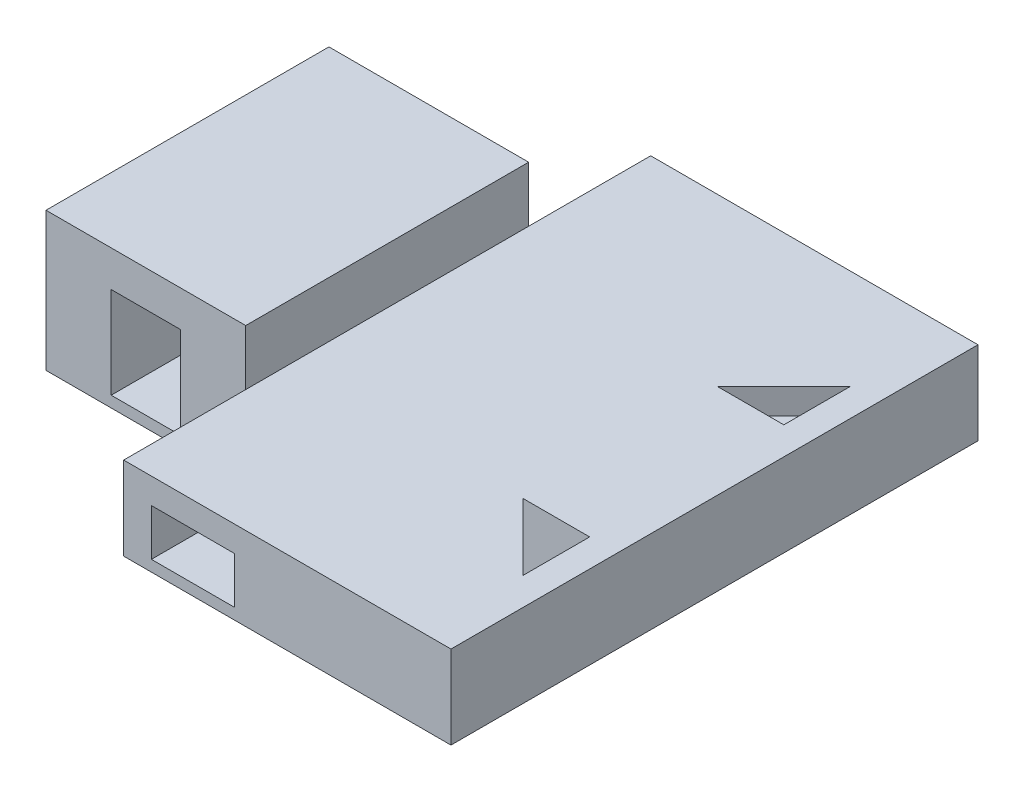
ISO-10303-21;
HEADER;
FILE_DESCRIPTION(('STEP AP214'),'2;1');
FILE_NAME('part.step','',(''),(''),'','','');
FILE_SCHEMA(('AUTOMOTIVE_DESIGN { 1 0 10303 214 1 1 1 1 }'));
ENDSEC;
DATA;
#1=APPLICATION_CONTEXT('core data for automotive mechanical design processes');
#2=APPLICATION_PROTOCOL_DEFINITION('international standard','automotive_design',2000,#1);
#3=PRODUCT_CONTEXT('',#1,'mechanical');
#4=PRODUCT('Part','Part','',(#3));
#5=PRODUCT_RELATED_PRODUCT_CATEGORY('part','',(#4));
#6=PRODUCT_DEFINITION_FORMATION('','',#4);
#7=PRODUCT_DEFINITION_CONTEXT('part definition',#1,'design');
#8=PRODUCT_DEFINITION('design','',#6,#7);
#9=PRODUCT_DEFINITION_SHAPE('','',#8);
#10=(LENGTH_UNIT() NAMED_UNIT(*) SI_UNIT(.MILLI.,.METRE.));
#11=(NAMED_UNIT(*) PLANE_ANGLE_UNIT() SI_UNIT($,.RADIAN.));
#12=(NAMED_UNIT(*) SI_UNIT($,.STERADIAN.) SOLID_ANGLE_UNIT());
#13=UNCERTAINTY_MEASURE_WITH_UNIT(LENGTH_MEASURE(1.E-05),#10,'distance_accuracy_value','');
#14=(GEOMETRIC_REPRESENTATION_CONTEXT(3) GLOBAL_UNCERTAINTY_ASSIGNED_CONTEXT((#13)) GLOBAL_UNIT_ASSIGNED_CONTEXT((#10,
#11,#12)) REPRESENTATION_CONTEXT('',''));
#15=CARTESIAN_POINT('',(0.,0.,0.));
#16=DIRECTION('',(0.,0.,1.));
#17=DIRECTION('',(1.,0.,0.));
#18=AXIS2_PLACEMENT_3D('',#15,#16,#17);
#19=CARTESIAN_POINT('',(0.,15.,0.));
#20=DIRECTION('',(0.,-1.,0.));
#21=DIRECTION('',(0.,0.,-1.));
#22=AXIS2_PLACEMENT_3D('',#19,#20,#21);
#23=PLANE('',#22);
#24=DIRECTION('',(-1.,0.,0.));
#25=VECTOR('',#24,1.);
#26=CARTESIAN_POINT('',(33.,15.,17.5));
#27=LINE('',#26,#25);
#28=CARTESIAN_POINT('',(45.,15.,17.5));
#29=VERTEX_POINT('',#28);
#30=CARTESIAN_POINT('',(33.,15.,17.5));
#31=VERTEX_POINT('',#30);
#32=EDGE_CURVE('E475',#29,#31,#27,.T.);
#33=ORIENTED_EDGE('',*,*,#32,.F.);
#34=DIRECTION('',(0.,0.,-1.));
#35=VECTOR('',#34,1.);
#36=CARTESIAN_POINT('',(45.,15.,29.5));
#37=LINE('',#36,#35);
#38=CARTESIAN_POINT('',(45.,15.,29.5));
#39=VERTEX_POINT('',#38);
#40=EDGE_CURVE('E455',#39,#29,#37,.T.);
#41=ORIENTED_EDGE('',*,*,#40,.F.);
#42=DIRECTION('',(0.707106781186547,0.,0.707106781186548));
#43=VECTOR('',#42,1.);
#44=CARTESIAN_POINT('',(45.,15.,29.5));
#45=LINE('',#44,#43);
#46=EDGE_CURVE('E466',#31,#39,#45,.T.);
#47=ORIENTED_EDGE('',*,*,#46,.F.);
#48=EDGE_LOOP('',(#33,#41,#47));
#49=FACE_BOUND('',#48,.T.);
#50=DIRECTION('',(1.,0.,0.));
#51=VECTOR('',#50,1.);
#52=CARTESIAN_POINT('',(33.,15.,-17.5));
#53=LINE('',#52,#51);
#54=CARTESIAN_POINT('',(33.,15.,-17.5));
#55=VERTEX_POINT('',#54);
#56=CARTESIAN_POINT('',(45.,15.,-17.5));
#57=VERTEX_POINT('',#56);
#58=EDGE_CURVE('E420',#55,#57,#53,.T.);
#59=ORIENTED_EDGE('',*,*,#58,.F.);
#60=DIRECTION('',(-0.707106781186547,0.,0.707106781186548));
#61=VECTOR('',#60,1.);
#62=CARTESIAN_POINT('',(33.,15.,-17.5));
#63=LINE('',#62,#61);
#64=CARTESIAN_POINT('',(45.,15.,-29.5));
#65=VERTEX_POINT('',#64);
#66=EDGE_CURVE('E401',#65,#55,#63,.T.);
#67=ORIENTED_EDGE('',*,*,#66,.F.);
#68=DIRECTION('',(0.,0.,-1.));
#69=VECTOR('',#68,1.);
#70=CARTESIAN_POINT('',(45.,15.,-17.5));
#71=LINE('',#70,#69);
#72=EDGE_CURVE('E423',#57,#65,#71,.T.);
#73=ORIENTED_EDGE('',*,*,#72,.F.);
#74=EDGE_LOOP('',(#59,#67,#73));
#75=FACE_BOUND('',#74,.T.);
#76=DIRECTION('',(0.,0.,-1.));
#77=VECTOR('',#76,1.);
#78=CARTESIAN_POINT('',(-9.,15.,25.5));
#79=LINE('',#78,#77);
#80=CARTESIAN_POINT('',(-9.,15.,25.5));
#81=VERTEX_POINT('',#80);
#82=CARTESIAN_POINT('',(-9.,15.,-25.5));
#83=VERTEX_POINT('',#82);
#84=EDGE_CURVE('E330',#81,#83,#79,.T.);
#85=ORIENTED_EDGE('',*,*,#84,.F.);
#86=DIRECTION('',(0.,0.,1.));
#87=VECTOR('',#86,1.);
#88=CARTESIAN_POINT('',(-9.,15.,25.5));
#89=LINE('',#88,#87);
#90=CARTESIAN_POINT('',(-9.,15.,47.5));
#91=VERTEX_POINT('',#90);
#92=EDGE_CURVE('E374',#81,#91,#89,.T.);
#93=ORIENTED_EDGE('',*,*,#92,.T.);
#94=DIRECTION('',(1.,0.,0.));
#95=VECTOR('',#94,1.);
#96=CARTESIAN_POINT('',(-45.,15.,47.5));
#97=LINE('',#96,#95);
#98=CARTESIAN_POINT('',(50.,15.,47.5));
#99=VERTEX_POINT('',#98);
#100=EDGE_CURVE('E522',#91,#99,#97,.T.);
#101=ORIENTED_EDGE('',*,*,#100,.T.);
#102=DIRECTION('',(0.,0.,1.));
#103=VECTOR('',#102,1.);
#104=CARTESIAN_POINT('',(50.,15.,47.5));
#105=LINE('',#104,#103);
#106=CARTESIAN_POINT('',(50.,15.,-47.5));
#107=VERTEX_POINT('',#106);
#108=EDGE_CURVE('E495',#107,#99,#105,.T.);
#109=ORIENTED_EDGE('',*,*,#108,.F.);
#110=DIRECTION('',(-1.,0.,0.));
#111=VECTOR('',#110,1.);
#112=CARTESIAN_POINT('',(-45.,15.,-47.5));
#113=LINE('',#112,#111);
#114=CARTESIAN_POINT('',(-9.,15.,-47.5));
#115=VERTEX_POINT('',#114);
#116=EDGE_CURVE('E519',#107,#115,#113,.T.);
#117=ORIENTED_EDGE('',*,*,#116,.T.);
#118=DIRECTION('',(0.,0.,-1.));
#119=VECTOR('',#118,1.);
#120=CARTESIAN_POINT('',(-9.,15.,-25.5));
#121=LINE('',#120,#119);
#122=EDGE_CURVE('E356',#83,#115,#121,.T.);
#123=ORIENTED_EDGE('',*,*,#122,.F.);
#124=EDGE_LOOP('',(#85,#93,#101,#109,#117,#123));
#125=FACE_BOUND('',#124,.T.);
#126=ADVANCED_FACE('F33',(#49,#75,#125),#23,.F.);
#127=CARTESIAN_POINT('',(-45.,15.,-47.5));
#128=DIRECTION('',(0.,0.,1.));
#129=DIRECTION('',(1.,0.,0.));
#130=AXIS2_PLACEMENT_3D('',#127,#128,#129);
#131=PLANE('',#130);
#132=DIRECTION('',(-1.,0.,0.));
#133=VECTOR('',#132,1.);
#134=CARTESIAN_POINT('',(11.,2.,-47.5));
#135=LINE('',#134,#133);
#136=CARTESIAN_POINT('',(11.,2.,-47.5));
#137=VERTEX_POINT('',#136);
#138=CARTESIAN_POINT('',(-4.,2.,-47.5));
#139=VERTEX_POINT('',#138);
#140=EDGE_CURVE('E269',#137,#139,#135,.T.);
#141=ORIENTED_EDGE('',*,*,#140,.F.);
#142=DIRECTION('',(0.,-1.,0.));
#143=VECTOR('',#142,1.);
#144=CARTESIAN_POINT('',(11.,2.,-47.5));
#145=LINE('',#144,#143);
#146=CARTESIAN_POINT('',(11.,10.4,-47.5));
#147=VERTEX_POINT('',#146);
#148=EDGE_CURVE('E48',#147,#137,#145,.T.);
#149=ORIENTED_EDGE('',*,*,#148,.F.);
#150=DIRECTION('',(1.,0.,0.));
#151=VECTOR('',#150,1.);
#152=CARTESIAN_POINT('',(11.,10.4,-47.5));
#153=LINE('',#152,#151);
#154=CARTESIAN_POINT('',(-4.,10.4,-47.5));
#155=VERTEX_POINT('',#154);
#156=EDGE_CURVE('E277',#155,#147,#153,.T.);
#157=ORIENTED_EDGE('',*,*,#156,.F.);
#158=DIRECTION('',(0.,1.,0.));
#159=VECTOR('',#158,1.);
#160=CARTESIAN_POINT('',(-4.,2.,-47.5));
#161=LINE('',#160,#159);
#162=EDGE_CURVE('E262',#139,#155,#161,.T.);
#163=ORIENTED_EDGE('',*,*,#162,.F.);
#164=EDGE_LOOP('',(#141,#149,#157,#163));
#165=FACE_BOUND('',#164,.T.);
#166=DIRECTION('',(-1.,0.,0.));
#167=VECTOR('',#166,1.);
#168=CARTESIAN_POINT('',(-45.,0.,-47.5));
#169=LINE('',#168,#167);
#170=CARTESIAN_POINT('',(50.,0.,-47.5));
#171=VERTEX_POINT('',#170);
#172=CARTESIAN_POINT('',(-9.,0.,-47.5));
#173=VERTEX_POINT('',#172);
#174=EDGE_CURVE('E513',#171,#173,#169,.T.);
#175=ORIENTED_EDGE('',*,*,#174,.T.);
#176=DIRECTION('',(0.,-1.,0.));
#177=VECTOR('',#176,1.);
#178=CARTESIAN_POINT('',(-9.,15.,-47.5));
#179=LINE('',#178,#177);
#180=EDGE_CURVE('E349',#115,#173,#179,.T.);
#181=ORIENTED_EDGE('',*,*,#180,.F.);
#182=ORIENTED_EDGE('',*,*,#116,.F.);
#183=DIRECTION('',(0.,1.,0.));
#184=VECTOR('',#183,1.);
#185=CARTESIAN_POINT('',(50.,0.,-47.5));
#186=LINE('',#185,#184);
#187=EDGE_CURVE('E492',#171,#107,#186,.T.);
#188=ORIENTED_EDGE('',*,*,#187,.F.);
#189=EDGE_LOOP('',(#175,#181,#182,#188));
#190=FACE_BOUND('',#189,.T.);
#191=ADVANCED_FACE('F35',(#165,#190),#131,.F.);
#192=CARTESIAN_POINT('',(-45.,15.,47.5));
#193=DIRECTION('',(1.,0.,0.));
#194=DIRECTION('',(0.,0.,-1.));
#195=AXIS2_PLACEMENT_3D('',#192,#193,#194);
#196=PLANE('',#195);
#197=DIRECTION('',(0.,-1.,0.));
#198=VECTOR('',#197,1.);
#199=CARTESIAN_POINT('',(-45.,0.,25.5));
#200=LINE('',#199,#198);
#201=CARTESIAN_POINT('',(-45.,25.,25.5));
#202=VERTEX_POINT('',#201);
#203=CARTESIAN_POINT('',(-45.,0.,25.5));
#204=VERTEX_POINT('',#203);
#205=EDGE_CURVE('E363',#202,#204,#200,.T.);
#206=ORIENTED_EDGE('',*,*,#205,.F.);
#207=DIRECTION('',(0.,0.,1.));
#208=VECTOR('',#207,1.);
#209=CARTESIAN_POINT('',(-45.,25.,25.5));
#210=LINE('',#209,#208);
#211=CARTESIAN_POINT('',(-45.,25.,-25.5));
#212=VERTEX_POINT('',#211);
#213=EDGE_CURVE('E331',#212,#202,#210,.T.);
#214=ORIENTED_EDGE('',*,*,#213,.F.);
#215=DIRECTION('',(0.,1.,0.));
#216=VECTOR('',#215,1.);
#217=CARTESIAN_POINT('',(-45.,15.,-25.5));
#218=LINE('',#217,#216);
#219=CARTESIAN_POINT('',(-45.,0.,-25.5));
#220=VERTEX_POINT('',#219);
#221=EDGE_CURVE('E350',#220,#212,#218,.T.);
#222=ORIENTED_EDGE('',*,*,#221,.F.);
#223=DIRECTION('',(0.,0.,1.));
#224=VECTOR('',#223,1.);
#225=CARTESIAN_POINT('',(-45.,0.,47.5));
#226=LINE('',#225,#224);
#227=EDGE_CURVE('E527',#220,#204,#226,.T.);
#228=ORIENTED_EDGE('',*,*,#227,.T.);
#229=EDGE_LOOP('',(#206,#214,#222,#228));
#230=FACE_BOUND('',#229,.T.);
#231=ADVANCED_FACE('F572',(#230),#196,.F.);
#232=CARTESIAN_POINT('',(-45.,15.,47.5));
#233=DIRECTION('',(0.,0.,-1.));
#234=DIRECTION('',(-1.,0.,0.));
#235=AXIS2_PLACEMENT_3D('',#232,#233,#234);
#236=PLANE('',#235);
#237=DIRECTION('',(1.,0.,0.));
#238=VECTOR('',#237,1.);
#239=CARTESIAN_POINT('',(-45.,10.4,47.5));
#240=LINE('',#239,#238);
#241=CARTESIAN_POINT('',(-4.,10.4,47.5));
#242=VERTEX_POINT('',#241);
#243=CARTESIAN_POINT('',(11.,10.4,47.5));
#244=VERTEX_POINT('',#243);
#245=EDGE_CURVE('E289',#242,#244,#240,.T.);
#246=ORIENTED_EDGE('',*,*,#245,.T.);
#247=DIRECTION('',(0.,-1.,0.));
#248=VECTOR('',#247,1.);
#249=CARTESIAN_POINT('',(11.,15.,47.5));
#250=LINE('',#249,#248);
#251=CARTESIAN_POINT('',(11.,2.,47.5));
#252=VERTEX_POINT('',#251);
#253=EDGE_CURVE('E295',#244,#252,#250,.T.);
#254=ORIENTED_EDGE('',*,*,#253,.T.);
#255=DIRECTION('',(-1.,0.,0.));
#256=VECTOR('',#255,1.);
#257=CARTESIAN_POINT('',(-45.,2.,47.5));
#258=LINE('',#257,#256);
#259=CARTESIAN_POINT('',(-4.,2.,47.5));
#260=VERTEX_POINT('',#259);
#261=EDGE_CURVE('E287',#252,#260,#258,.T.);
#262=ORIENTED_EDGE('',*,*,#261,.T.);
#263=DIRECTION('',(0.,1.,0.));
#264=VECTOR('',#263,1.);
#265=CARTESIAN_POINT('',(-4.,15.,47.5));
#266=LINE('',#265,#264);
#267=EDGE_CURVE('E11',#260,#242,#266,.T.);
#268=ORIENTED_EDGE('',*,*,#267,.T.);
#269=EDGE_LOOP('',(#246,#254,#262,#268));
#270=FACE_BOUND('',#269,.T.);
#271=ORIENTED_EDGE('',*,*,#100,.F.);
#272=DIRECTION('',(0.,1.,0.));
#273=VECTOR('',#272,1.);
#274=CARTESIAN_POINT('',(-9.,0.,47.5));
#275=LINE('',#274,#273);
#276=CARTESIAN_POINT('',(-9.,0.,47.5));
#277=VERTEX_POINT('',#276);
#278=EDGE_CURVE('E361',#277,#91,#275,.T.);
#279=ORIENTED_EDGE('',*,*,#278,.F.);
#280=DIRECTION('',(1.,0.,0.));
#281=VECTOR('',#280,1.);
#282=CARTESIAN_POINT('',(-45.,0.,47.5));
#283=LINE('',#282,#281);
#284=CARTESIAN_POINT('',(50.,0.,47.5));
#285=VERTEX_POINT('',#284);
#286=EDGE_CURVE('E523',#277,#285,#283,.T.);
#287=ORIENTED_EDGE('',*,*,#286,.T.);
#288=DIRECTION('',(0.,-1.,0.));
#289=VECTOR('',#288,1.);
#290=CARTESIAN_POINT('',(50.,0.,47.5));
#291=LINE('',#290,#289);
#292=EDGE_CURVE('E482',#99,#285,#291,.T.);
#293=ORIENTED_EDGE('',*,*,#292,.F.);
#294=EDGE_LOOP('',(#271,#279,#287,#293));
#295=FACE_BOUND('',#294,.T.);
#296=ADVANCED_FACE('F552',(#270,#295),#236,.F.);
#297=CARTESIAN_POINT('',(0.,0.,0.));
#298=DIRECTION('',(0.,-1.,0.));
#299=DIRECTION('',(0.,0.,-1.));
#300=AXIS2_PLACEMENT_3D('',#297,#298,#299);
#301=PLANE('',#300);
#302=DIRECTION('',(0.,0.,-1.));
#303=VECTOR('',#302,1.);
#304=CARTESIAN_POINT('',(-9.,0.,-25.5));
#305=LINE('',#304,#303);
#306=CARTESIAN_POINT('',(-9.,0.,-25.5));
#307=VERTEX_POINT('',#306);
#308=EDGE_CURVE('E358',#307,#173,#305,.T.);
#309=ORIENTED_EDGE('',*,*,#308,.T.);
#310=ORIENTED_EDGE('',*,*,#174,.F.);
#311=DIRECTION('',(0.,0.,-1.));
#312=VECTOR('',#311,1.);
#313=CARTESIAN_POINT('',(50.,0.,47.5));
#314=LINE('',#313,#312);
#315=EDGE_CURVE('E489',#285,#171,#314,.T.);
#316=ORIENTED_EDGE('',*,*,#315,.F.);
#317=ORIENTED_EDGE('',*,*,#286,.F.);
#318=DIRECTION('',(0.,0.,1.));
#319=VECTOR('',#318,1.);
#320=CARTESIAN_POINT('',(-9.,0.,25.5));
#321=LINE('',#320,#319);
#322=CARTESIAN_POINT('',(-9.,0.,25.5));
#323=VERTEX_POINT('',#322);
#324=EDGE_CURVE('E372',#323,#277,#321,.T.);
#325=ORIENTED_EDGE('',*,*,#324,.F.);
#326=DIRECTION('',(1.,0.,0.));
#327=VECTOR('',#326,1.);
#328=CARTESIAN_POINT('',(-45.,0.,25.5));
#329=LINE('',#328,#327);
#330=EDGE_CURVE('E366',#204,#323,#329,.T.);
#331=ORIENTED_EDGE('',*,*,#330,.F.);
#332=ORIENTED_EDGE('',*,*,#227,.F.);
#333=DIRECTION('',(-1.,0.,0.));
#334=VECTOR('',#333,1.);
#335=CARTESIAN_POINT('',(-45.,0.,-25.5));
#336=LINE('',#335,#334);
#337=EDGE_CURVE('E354',#307,#220,#336,.T.);
#338=ORIENTED_EDGE('',*,*,#337,.F.);
#339=EDGE_LOOP('',(#309,#310,#316,#317,#325,#331,#332,#338));
#340=FACE_BOUND('',#339,.T.);
#341=ADVANCED_FACE('F577',(#340),#301,.T.);
#342=CARTESIAN_POINT('',(50.,0.,0.));
#343=DIRECTION('',(-1.,0.,0.));
#344=DIRECTION('',(0.,0.,1.));
#345=AXIS2_PLACEMENT_3D('',#342,#343,#344);
#346=PLANE('',#345);
#347=ORIENTED_EDGE('',*,*,#292,.T.);
#348=ORIENTED_EDGE('',*,*,#315,.T.);
#349=ORIENTED_EDGE('',*,*,#187,.T.);
#350=ORIENTED_EDGE('',*,*,#108,.T.);
#351=EDGE_LOOP('',(#347,#348,#349,#350));
#352=FACE_BOUND('',#351,.T.);
#353=ADVANCED_FACE('F580',(#352),#346,.F.);
#354=CARTESIAN_POINT('',(45.,2.,29.5));
#355=DIRECTION('',(1.,0.,0.));
#356=DIRECTION('',(0.,0.,-1.));
#357=AXIS2_PLACEMENT_3D('',#354,#355,#356);
#358=PLANE('',#357);
#359=ORIENTED_EDGE('',*,*,#40,.T.);
#360=DIRECTION('',(0.,1.,0.));
#361=VECTOR('',#360,1.);
#362=CARTESIAN_POINT('',(45.,2.,17.5));
#363=LINE('',#362,#361);
#364=CARTESIAN_POINT('',(45.,2.,17.5));
#365=VERTEX_POINT('',#364);
#366=EDGE_CURVE('E473',#365,#29,#363,.T.);
#367=ORIENTED_EDGE('',*,*,#366,.F.);
#368=DIRECTION('',(0.,0.,-1.));
#369=VECTOR('',#368,1.);
#370=CARTESIAN_POINT('',(45.,2.,29.5));
#371=LINE('',#370,#369);
#372=CARTESIAN_POINT('',(45.,2.,29.5));
#373=VERTEX_POINT('',#372);
#374=EDGE_CURVE('E462',#373,#365,#371,.T.);
#375=ORIENTED_EDGE('',*,*,#374,.F.);
#376=DIRECTION('',(0.,1.,0.));
#377=VECTOR('',#376,1.);
#378=CARTESIAN_POINT('',(45.,2.,29.5));
#379=LINE('',#378,#377);
#380=EDGE_CURVE('E480',#373,#39,#379,.T.);
#381=ORIENTED_EDGE('',*,*,#380,.T.);
#382=EDGE_LOOP('',(#359,#367,#375,#381));
#383=FACE_BOUND('',#382,.T.);
#384=ADVANCED_FACE('F692',(#383),#358,.F.);
#385=CARTESIAN_POINT('',(45.,2.,29.5));
#386=DIRECTION('',(-0.707106781186548,0.,0.707106781186547));
#387=DIRECTION('',(0.707106781186547,0.,0.707106781186548));
#388=AXIS2_PLACEMENT_3D('',#385,#386,#387);
#389=PLANE('',#388);
#390=DIRECTION('',(0.707106781186547,0.,0.707106781186548));
#391=VECTOR('',#390,1.);
#392=CARTESIAN_POINT('',(33.7071067811865,10.4,18.2071067811865));
#393=LINE('',#392,#391);
#394=CARTESIAN_POINT('',(33.7071067811865,10.4,18.2071067811865));
#395=VERTEX_POINT('',#394);
#396=CARTESIAN_POINT('',(44.3137084989848,10.4,28.8137084989848));
#397=VERTEX_POINT('',#396);
#398=EDGE_CURVE('E449',#395,#397,#393,.T.);
#399=ORIENTED_EDGE('',*,*,#398,.F.);
#400=DIRECTION('',(0.,1.,0.));
#401=VECTOR('',#400,1.);
#402=CARTESIAN_POINT('',(33.7071067811865,10.4,18.2071067811865));
#403=LINE('',#402,#401);
#404=CARTESIAN_POINT('',(33.7071067811865,2.,18.2071067811865));
#405=VERTEX_POINT('',#404);
#406=EDGE_CURVE('E428',#405,#395,#403,.T.);
#407=ORIENTED_EDGE('',*,*,#406,.F.);
#408=DIRECTION('',(0.707106781186547,0.,0.707106781186548));
#409=VECTOR('',#408,1.);
#410=CARTESIAN_POINT('',(45.,2.,29.5));
#411=LINE('',#410,#409);
#412=CARTESIAN_POINT('',(33.,2.,17.5));
#413=VERTEX_POINT('',#412);
#414=EDGE_CURVE('E470',#413,#405,#411,.T.);
#415=ORIENTED_EDGE('',*,*,#414,.F.);
#416=DIRECTION('',(0.,1.,0.));
#417=VECTOR('',#416,1.);
#418=CARTESIAN_POINT('',(33.,2.,17.5));
#419=LINE('',#418,#417);
#420=EDGE_CURVE('E483',#413,#31,#419,.T.);
#421=ORIENTED_EDGE('',*,*,#420,.T.);
#422=ORIENTED_EDGE('',*,*,#46,.T.);
#423=ORIENTED_EDGE('',*,*,#380,.F.);
#424=CARTESIAN_POINT('',(44.3137084989848,2.,28.8137084989848));
#425=VERTEX_POINT('',#424);
#426=EDGE_CURVE('E469',#425,#373,#411,.T.);
#427=ORIENTED_EDGE('',*,*,#426,.F.);
#428=DIRECTION('',(0.,-1.,0.));
#429=VECTOR('',#428,1.);
#430=CARTESIAN_POINT('',(44.3137084989848,10.4,28.8137084989848));
#431=LINE('',#430,#429);
#432=EDGE_CURVE('E437',#397,#425,#431,.T.);
#433=ORIENTED_EDGE('',*,*,#432,.F.);
#434=EDGE_LOOP('',(#399,#407,#415,#421,#422,#423,#427,#433));
#435=FACE_BOUND('',#434,.T.);
#436=ADVANCED_FACE('F689',(#435),#389,.F.);
#437=CARTESIAN_POINT('',(33.,2.,17.5));
#438=DIRECTION('',(0.,0.,-1.));
#439=DIRECTION('',(-1.,0.,0.));
#440=AXIS2_PLACEMENT_3D('',#437,#438,#439);
#441=PLANE('',#440);
#442=ORIENTED_EDGE('',*,*,#32,.T.);
#443=ORIENTED_EDGE('',*,*,#420,.F.);
#444=DIRECTION('',(-1.,0.,0.));
#445=VECTOR('',#444,1.);
#446=CARTESIAN_POINT('',(33.,2.,17.5));
#447=LINE('',#446,#445);
#448=EDGE_CURVE('E465',#365,#413,#447,.T.);
#449=ORIENTED_EDGE('',*,*,#448,.F.);
#450=ORIENTED_EDGE('',*,*,#366,.T.);
#451=EDGE_LOOP('',(#442,#443,#449,#450));
#452=FACE_BOUND('',#451,.T.);
#453=ADVANCED_FACE('F687',(#452),#441,.F.);
#454=CARTESIAN_POINT('',(0.,2.,0.));
#455=DIRECTION('',(0.,-1.,0.));
#456=DIRECTION('',(0.,0.,-1.));
#457=AXIS2_PLACEMENT_3D('',#454,#455,#456);
#458=PLANE('',#457);
#459=ORIENTED_EDGE('',*,*,#374,.T.);
#460=ORIENTED_EDGE('',*,*,#448,.T.);
#461=ORIENTED_EDGE('',*,*,#414,.T.);
#462=DIRECTION('',(0.707106781186548,0.,-0.707106781186547));
#463=VECTOR('',#462,1.);
#464=CARTESIAN_POINT('',(19.5649711574556,2.,32.3492424049175));
#465=LINE('',#464,#463);
#466=CARTESIAN_POINT('',(19.5649711574556,2.,32.3492424049175));
#467=VERTEX_POINT('',#466);
#468=EDGE_CURVE('E453',#467,#405,#465,.T.);
#469=ORIENTED_EDGE('',*,*,#468,.F.);
#470=DIRECTION('',(-0.707106781186547,0.,-0.707106781186548));
#471=VECTOR('',#470,1.);
#472=CARTESIAN_POINT('',(19.5649711574556,2.,32.3492424049175));
#473=LINE('',#472,#471);
#474=CARTESIAN_POINT('',(30.1715728752538,2.,42.9558441227157));
#475=VERTEX_POINT('',#474);
#476=EDGE_CURVE('E443',#475,#467,#473,.T.);
#477=ORIENTED_EDGE('',*,*,#476,.F.);
#478=DIRECTION('',(0.707106781186548,0.,-0.707106781186547));
#479=VECTOR('',#478,1.);
#480=CARTESIAN_POINT('',(30.1715728752538,2.,42.9558441227157));
#481=LINE('',#480,#479);
#482=EDGE_CURVE('E456',#475,#425,#481,.T.);
#483=ORIENTED_EDGE('',*,*,#482,.T.);
#484=ORIENTED_EDGE('',*,*,#426,.T.);
#485=EDGE_LOOP('',(#459,#460,#461,#469,#477,#483,#484));
#486=FACE_BOUND('',#485,.T.);
#487=ADVANCED_FACE('F683',(#486),#458,.F.);
#488=CARTESIAN_POINT('',(19.5649711574556,10.4,32.3492424049175));
#489=DIRECTION('',(-0.707106781186547,0.,-0.707106781186548));
#490=DIRECTION('',(-0.707106781186548,0.,0.707106781186547));
#491=AXIS2_PLACEMENT_3D('',#488,#489,#490);
#492=PLANE('',#491);
#493=ORIENTED_EDGE('',*,*,#406,.T.);
#494=DIRECTION('',(0.707106781186548,0.,-0.707106781186547));
#495=VECTOR('',#494,1.);
#496=CARTESIAN_POINT('',(19.5649711574556,10.4,32.3492424049175));
#497=LINE('',#496,#495);
#498=CARTESIAN_POINT('',(19.5649711574556,10.4,32.3492424049175));
#499=VERTEX_POINT('',#498);
#500=EDGE_CURVE('E446',#499,#395,#497,.T.);
#501=ORIENTED_EDGE('',*,*,#500,.F.);
#502=DIRECTION('',(0.,1.,0.));
#503=VECTOR('',#502,1.);
#504=CARTESIAN_POINT('',(19.5649711574556,10.4,32.3492424049175));
#505=LINE('',#504,#503);
#506=EDGE_CURVE('E433',#467,#499,#505,.T.);
#507=ORIENTED_EDGE('',*,*,#506,.F.);
#508=ORIENTED_EDGE('',*,*,#468,.T.);
#509=EDGE_LOOP('',(#493,#501,#507,#508));
#510=FACE_BOUND('',#509,.T.);
#511=ADVANCED_FACE('F676',(#510),#492,.F.);
#512=CARTESIAN_POINT('',(30.1715728752538,10.4,42.9558441227157));
#513=DIRECTION('',(0.707106781186547,0.,0.707106781186548));
#514=DIRECTION('',(0.707106781186548,0.,-0.707106781186547));
#515=AXIS2_PLACEMENT_3D('',#512,#513,#514);
#516=PLANE('',#515);
#517=ORIENTED_EDGE('',*,*,#432,.T.);
#518=ORIENTED_EDGE('',*,*,#482,.F.);
#519=DIRECTION('',(0.,-1.,0.));
#520=VECTOR('',#519,1.);
#521=CARTESIAN_POINT('',(30.1715728752538,10.4,42.9558441227157));
#522=LINE('',#521,#520);
#523=CARTESIAN_POINT('',(30.1715728752538,10.4,42.9558441227157));
#524=VERTEX_POINT('',#523);
#525=EDGE_CURVE('E440',#524,#475,#522,.T.);
#526=ORIENTED_EDGE('',*,*,#525,.F.);
#527=DIRECTION('',(0.707106781186548,0.,-0.707106781186547));
#528=VECTOR('',#527,1.);
#529=CARTESIAN_POINT('',(30.1715728752538,10.4,42.9558441227157));
#530=LINE('',#529,#528);
#531=EDGE_CURVE('E459',#524,#397,#530,.T.);
#532=ORIENTED_EDGE('',*,*,#531,.T.);
#533=EDGE_LOOP('',(#517,#518,#526,#532));
#534=FACE_BOUND('',#533,.T.);
#535=ADVANCED_FACE('F673',(#534),#516,.F.);
#536=CARTESIAN_POINT('',(19.5649711574556,10.4,32.3492424049175));
#537=DIRECTION('',(0.,1.,0.));
#538=DIRECTION('',(0.,0.,1.));
#539=AXIS2_PLACEMENT_3D('',#536,#537,#538);
#540=PLANE('',#539);
#541=ORIENTED_EDGE('',*,*,#398,.T.);
#542=ORIENTED_EDGE('',*,*,#531,.F.);
#543=DIRECTION('',(0.707106781186547,0.,0.707106781186548));
#544=VECTOR('',#543,1.);
#545=CARTESIAN_POINT('',(19.5649711574556,10.4,32.3492424049175));
#546=LINE('',#545,#544);
#547=EDGE_CURVE('E436',#499,#524,#546,.T.);
#548=ORIENTED_EDGE('',*,*,#547,.F.);
#549=ORIENTED_EDGE('',*,*,#500,.T.);
#550=EDGE_LOOP('',(#541,#542,#548,#549));
#551=FACE_BOUND('',#550,.T.);
#552=ADVANCED_FACE('F671',(#551),#540,.F.);
#553=CARTESIAN_POINT('',(-6.39213562373094,0.,6.39213562373094));
#554=DIRECTION('',(-0.707106781186548,0.,0.707106781186547));
#555=DIRECTION('',(0.707106781186547,0.,0.707106781186548));
#556=AXIS2_PLACEMENT_3D('',#553,#554,#555);
#557=PLANE('',#556);
#558=ORIENTED_EDGE('',*,*,#506,.T.);
#559=ORIENTED_EDGE('',*,*,#547,.T.);
#560=ORIENTED_EDGE('',*,*,#525,.T.);
#561=ORIENTED_EDGE('',*,*,#476,.T.);
#562=EDGE_LOOP('',(#558,#559,#560,#561));
#563=FACE_BOUND('',#562,.T.);
#564=ADVANCED_FACE('F667',(#563),#557,.F.);
#565=CARTESIAN_POINT('',(33.,2.,-17.5));
#566=DIRECTION('',(-0.707106781186548,0.,-0.707106781186547));
#567=DIRECTION('',(-0.707106781186547,0.,0.707106781186548));
#568=AXIS2_PLACEMENT_3D('',#565,#566,#567);
#569=PLANE('',#568);
#570=DIRECTION('',(-0.707106781186547,0.,0.707106781186548));
#571=VECTOR('',#570,1.);
#572=CARTESIAN_POINT('',(33.,2.,-17.5));
#573=LINE('',#572,#571);
#574=CARTESIAN_POINT('',(33.7071067811865,2.,-18.2071067811865));
#575=VERTEX_POINT('',#574);
#576=CARTESIAN_POINT('',(33.,2.,-17.5));
#577=VERTEX_POINT('',#576);
#578=EDGE_CURVE('E412',#575,#577,#573,.T.);
#579=ORIENTED_EDGE('',*,*,#578,.F.);
#580=DIRECTION('',(0.,-1.,0.));
#581=VECTOR('',#580,1.);
#582=CARTESIAN_POINT('',(33.7071067811865,2.,-18.2071067811865));
#583=LINE('',#582,#581);
#584=CARTESIAN_POINT('',(33.7071067811865,10.4,-18.2071067811865));
#585=VERTEX_POINT('',#584);
#586=EDGE_CURVE('E377',#585,#575,#583,.T.);
#587=ORIENTED_EDGE('',*,*,#586,.F.);
#588=DIRECTION('',(-0.707106781186547,0.,0.707106781186548));
#589=VECTOR('',#588,1.);
#590=CARTESIAN_POINT('',(33.7071067811865,10.4,-18.2071067811865));
#591=LINE('',#590,#589);
#592=CARTESIAN_POINT('',(44.3137084989848,10.4,-28.8137084989848));
#593=VERTEX_POINT('',#592);
#594=EDGE_CURVE('E383',#593,#585,#591,.T.);
#595=ORIENTED_EDGE('',*,*,#594,.F.);
#596=DIRECTION('',(0.,1.,0.));
#597=VECTOR('',#596,1.);
#598=CARTESIAN_POINT('',(44.3137084989848,2.,-28.8137084989848));
#599=LINE('',#598,#597);
#600=CARTESIAN_POINT('',(44.3137084989848,2.,-28.8137084989848));
#601=VERTEX_POINT('',#600);
#602=EDGE_CURVE('E394',#601,#593,#599,.T.);
#603=ORIENTED_EDGE('',*,*,#602,.F.);
#604=CARTESIAN_POINT('',(45.,2.,-29.5));
#605=VERTEX_POINT('',#604);
#606=EDGE_CURVE('E408',#605,#601,#573,.T.);
#607=ORIENTED_EDGE('',*,*,#606,.F.);
#608=DIRECTION('',(0.,1.,0.));
#609=VECTOR('',#608,1.);
#610=CARTESIAN_POINT('',(45.,2.,-29.5));
#611=LINE('',#610,#609);
#612=EDGE_CURVE('E426',#605,#65,#611,.T.);
#613=ORIENTED_EDGE('',*,*,#612,.T.);
#614=ORIENTED_EDGE('',*,*,#66,.T.);
#615=DIRECTION('',(0.,1.,0.));
#616=VECTOR('',#615,1.);
#617=CARTESIAN_POINT('',(33.,2.,-17.5));
#618=LINE('',#617,#616);
#619=EDGE_CURVE('E418',#577,#55,#618,.T.);
#620=ORIENTED_EDGE('',*,*,#619,.F.);
#621=EDGE_LOOP('',(#579,#587,#595,#603,#607,#613,#614,#620));
#622=FACE_BOUND('',#621,.T.);
#623=ADVANCED_FACE('F660',(#622),#569,.F.);
#624=CARTESIAN_POINT('',(45.,2.,-17.5));
#625=DIRECTION('',(1.,0.,0.));
#626=DIRECTION('',(0.,0.,-1.));
#627=AXIS2_PLACEMENT_3D('',#624,#625,#626);
#628=PLANE('',#627);
#629=ORIENTED_EDGE('',*,*,#72,.T.);
#630=ORIENTED_EDGE('',*,*,#612,.F.);
#631=DIRECTION('',(0.,0.,-1.));
#632=VECTOR('',#631,1.);
#633=CARTESIAN_POINT('',(45.,2.,-17.5));
#634=LINE('',#633,#632);
#635=CARTESIAN_POINT('',(45.,2.,-17.5));
#636=VERTEX_POINT('',#635);
#637=EDGE_CURVE('E415',#636,#605,#634,.T.);
#638=ORIENTED_EDGE('',*,*,#637,.F.);
#639=DIRECTION('',(0.,1.,0.));
#640=VECTOR('',#639,1.);
#641=CARTESIAN_POINT('',(45.,2.,-17.5));
#642=LINE('',#641,#640);
#643=EDGE_CURVE('E429',#636,#57,#642,.T.);
#644=ORIENTED_EDGE('',*,*,#643,.T.);
#645=EDGE_LOOP('',(#629,#630,#638,#644));
#646=FACE_BOUND('',#645,.T.);
#647=ADVANCED_FACE('F657',(#646),#628,.F.);
#648=CARTESIAN_POINT('',(33.,2.,-17.5));
#649=DIRECTION('',(0.,0.,1.));
#650=DIRECTION('',(1.,0.,0.));
#651=AXIS2_PLACEMENT_3D('',#648,#649,#650);
#652=PLANE('',#651);
#653=ORIENTED_EDGE('',*,*,#58,.T.);
#654=ORIENTED_EDGE('',*,*,#643,.F.);
#655=DIRECTION('',(1.,0.,0.));
#656=VECTOR('',#655,1.);
#657=CARTESIAN_POINT('',(33.,2.,-17.5));
#658=LINE('',#657,#656);
#659=EDGE_CURVE('E411',#577,#636,#658,.T.);
#660=ORIENTED_EDGE('',*,*,#659,.F.);
#661=ORIENTED_EDGE('',*,*,#619,.T.);
#662=EDGE_LOOP('',(#653,#654,#660,#661));
#663=FACE_BOUND('',#662,.T.);
#664=ADVANCED_FACE('F655',(#663),#652,.F.);
#665=CARTESIAN_POINT('',(0.,2.,0.));
#666=DIRECTION('',(0.,1.,0.));
#667=DIRECTION('',(0.,0.,1.));
#668=AXIS2_PLACEMENT_3D('',#665,#666,#667);
#669=PLANE('',#668);
#670=ORIENTED_EDGE('',*,*,#606,.T.);
#671=DIRECTION('',(0.707106781186548,0.,0.707106781186547));
#672=VECTOR('',#671,1.);
#673=CARTESIAN_POINT('',(30.1715728752538,2.,-42.9558441227157));
#674=LINE('',#673,#672);
#675=CARTESIAN_POINT('',(30.1715728752538,2.,-42.9558441227157));
#676=VERTEX_POINT('',#675);
#677=EDGE_CURVE('E404',#676,#601,#674,.T.);
#678=ORIENTED_EDGE('',*,*,#677,.F.);
#679=DIRECTION('',(0.707106781186547,0.,-0.707106781186548));
#680=VECTOR('',#679,1.);
#681=CARTESIAN_POINT('',(19.5649711574556,2.,-32.3492424049175));
#682=LINE('',#681,#680);
#683=CARTESIAN_POINT('',(19.5649711574556,2.,-32.3492424049175));
#684=VERTEX_POINT('',#683);
#685=EDGE_CURVE('E382',#684,#676,#682,.T.);
#686=ORIENTED_EDGE('',*,*,#685,.F.);
#687=DIRECTION('',(0.707106781186548,0.,0.707106781186547));
#688=VECTOR('',#687,1.);
#689=CARTESIAN_POINT('',(19.5649711574556,2.,-32.3492424049175));
#690=LINE('',#689,#688);
#691=EDGE_CURVE('E392',#684,#575,#690,.T.);
#692=ORIENTED_EDGE('',*,*,#691,.T.);
#693=ORIENTED_EDGE('',*,*,#578,.T.);
#694=ORIENTED_EDGE('',*,*,#659,.T.);
#695=ORIENTED_EDGE('',*,*,#637,.T.);
#696=EDGE_LOOP('',(#670,#678,#686,#692,#693,#694,#695));
#697=FACE_BOUND('',#696,.T.);
#698=ADVANCED_FACE('F651',(#697),#669,.T.);
#699=CARTESIAN_POINT('',(19.5649711574556,2.,-32.3492424049175));
#700=DIRECTION('',(-0.707106781186547,0.,0.707106781186548));
#701=DIRECTION('',(0.707106781186548,0.,0.707106781186547));
#702=AXIS2_PLACEMENT_3D('',#699,#700,#701);
#703=PLANE('',#702);
#704=ORIENTED_EDGE('',*,*,#586,.T.);
#705=ORIENTED_EDGE('',*,*,#691,.F.);
#706=DIRECTION('',(0.,-1.,0.));
#707=VECTOR('',#706,1.);
#708=CARTESIAN_POINT('',(19.5649711574556,2.,-32.3492424049175));
#709=LINE('',#708,#707);
#710=CARTESIAN_POINT('',(19.5649711574556,10.4,-32.3492424049175));
#711=VERTEX_POINT('',#710);
#712=EDGE_CURVE('E379',#711,#684,#709,.T.);
#713=ORIENTED_EDGE('',*,*,#712,.F.);
#714=DIRECTION('',(0.707106781186548,0.,0.707106781186547));
#715=VECTOR('',#714,1.);
#716=CARTESIAN_POINT('',(19.5649711574556,10.4,-32.3492424049175));
#717=LINE('',#716,#715);
#718=EDGE_CURVE('E399',#711,#585,#717,.T.);
#719=ORIENTED_EDGE('',*,*,#718,.T.);
#720=EDGE_LOOP('',(#704,#705,#713,#719));
#721=FACE_BOUND('',#720,.T.);
#722=ADVANCED_FACE('F644',(#721),#703,.F.);
#723=CARTESIAN_POINT('',(19.5649711574556,10.4,-32.3492424049175));
#724=DIRECTION('',(0.,1.,0.));
#725=DIRECTION('',(0.,0.,1.));
#726=AXIS2_PLACEMENT_3D('',#723,#724,#725);
#727=PLANE('',#726);
#728=ORIENTED_EDGE('',*,*,#594,.T.);
#729=ORIENTED_EDGE('',*,*,#718,.F.);
#730=DIRECTION('',(-0.707106781186547,0.,0.707106781186548));
#731=VECTOR('',#730,1.);
#732=CARTESIAN_POINT('',(19.5649711574556,10.4,-32.3492424049175));
#733=LINE('',#732,#731);
#734=CARTESIAN_POINT('',(30.1715728752538,10.4,-42.9558441227157));
#735=VERTEX_POINT('',#734);
#736=EDGE_CURVE('E389',#735,#711,#733,.T.);
#737=ORIENTED_EDGE('',*,*,#736,.F.);
#738=DIRECTION('',(0.707106781186548,0.,0.707106781186547));
#739=VECTOR('',#738,1.);
#740=CARTESIAN_POINT('',(30.1715728752538,10.4,-42.9558441227157));
#741=LINE('',#740,#739);
#742=EDGE_CURVE('E402',#735,#593,#741,.T.);
#743=ORIENTED_EDGE('',*,*,#742,.T.);
#744=EDGE_LOOP('',(#728,#729,#737,#743));
#745=FACE_BOUND('',#744,.T.);
#746=ADVANCED_FACE('F641',(#745),#727,.F.);
#747=CARTESIAN_POINT('',(30.1715728752538,2.,-42.9558441227157));
#748=DIRECTION('',(0.707106781186547,0.,-0.707106781186548));
#749=DIRECTION('',(-0.707106781186548,0.,-0.707106781186547));
#750=AXIS2_PLACEMENT_3D('',#747,#748,#749);
#751=PLANE('',#750);
#752=ORIENTED_EDGE('',*,*,#602,.T.);
#753=ORIENTED_EDGE('',*,*,#742,.F.);
#754=DIRECTION('',(0.,1.,0.));
#755=VECTOR('',#754,1.);
#756=CARTESIAN_POINT('',(30.1715728752538,2.,-42.9558441227157));
#757=LINE('',#756,#755);
#758=EDGE_CURVE('E386',#676,#735,#757,.T.);
#759=ORIENTED_EDGE('',*,*,#758,.F.);
#760=ORIENTED_EDGE('',*,*,#677,.T.);
#761=EDGE_LOOP('',(#752,#753,#759,#760));
#762=FACE_BOUND('',#761,.T.);
#763=ADVANCED_FACE('F639',(#762),#751,.F.);
#764=CARTESIAN_POINT('',(-6.39213562373094,0.,-6.39213562373094));
#765=DIRECTION('',(-0.707106781186548,0.,-0.707106781186547));
#766=DIRECTION('',(-0.707106781186547,0.,0.707106781186548));
#767=AXIS2_PLACEMENT_3D('',#764,#765,#766);
#768=PLANE('',#767);
#769=ORIENTED_EDGE('',*,*,#712,.T.);
#770=ORIENTED_EDGE('',*,*,#685,.T.);
#771=ORIENTED_EDGE('',*,*,#758,.T.);
#772=ORIENTED_EDGE('',*,*,#736,.T.);
#773=EDGE_LOOP('',(#769,#770,#771,#772));
#774=FACE_BOUND('',#773,.T.);
#775=ADVANCED_FACE('F636',(#774),#768,.F.);
#776=CARTESIAN_POINT('',(-9.,0.,25.5));
#777=DIRECTION('',(1.,0.,0.));
#778=DIRECTION('',(0.,0.,-1.));
#779=AXIS2_PLACEMENT_3D('',#776,#777,#778);
#780=PLANE('',#779);
#781=ORIENTED_EDGE('',*,*,#278,.T.);
#782=ORIENTED_EDGE('',*,*,#92,.F.);
#783=DIRECTION('',(0.,1.,0.));
#784=VECTOR('',#783,1.);
#785=CARTESIAN_POINT('',(-9.,0.,25.5));
#786=LINE('',#785,#784);
#787=EDGE_CURVE('E369',#323,#81,#786,.T.);
#788=ORIENTED_EDGE('',*,*,#787,.F.);
#789=ORIENTED_EDGE('',*,*,#324,.T.);
#790=EDGE_LOOP('',(#781,#782,#788,#789));
#791=FACE_BOUND('',#790,.T.);
#792=ADVANCED_FACE('F613',(#791),#780,.F.);
#793=CARTESIAN_POINT('',(0.,0.,25.5));
#794=DIRECTION('',(0.,0.,-1.));
#795=DIRECTION('',(-1.,0.,0.));
#796=AXIS2_PLACEMENT_3D('',#793,#794,#795);
#797=PLANE('',#796);
#798=DIRECTION('',(1.,0.,0.));
#799=VECTOR('',#798,1.);
#800=CARTESIAN_POINT('',(0.,18.5,25.5));
#801=LINE('',#800,#799);
#802=CARTESIAN_POINT('',(-33.25,18.5,25.5));
#803=VERTEX_POINT('',#802);
#804=CARTESIAN_POINT('',(-20.75,18.5,25.5));
#805=VERTEX_POINT('',#804);
#806=EDGE_CURVE('E324',#803,#805,#801,.T.);
#807=ORIENTED_EDGE('',*,*,#806,.T.);
#808=DIRECTION('',(0.,-1.,0.));
#809=VECTOR('',#808,1.);
#810=CARTESIAN_POINT('',(-20.75,0.,25.5));
#811=LINE('',#810,#809);
#812=CARTESIAN_POINT('',(-20.75,2.,25.5));
#813=VERTEX_POINT('',#812);
#814=EDGE_CURVE('E327',#805,#813,#811,.T.);
#815=ORIENTED_EDGE('',*,*,#814,.T.);
#816=DIRECTION('',(-1.,0.,0.));
#817=VECTOR('',#816,1.);
#818=CARTESIAN_POINT('',(0.,2.,25.5));
#819=LINE('',#818,#817);
#820=CARTESIAN_POINT('',(-33.25,2.,25.5));
#821=VERTEX_POINT('',#820);
#822=EDGE_CURVE('E312',#813,#821,#819,.T.);
#823=ORIENTED_EDGE('',*,*,#822,.T.);
#824=DIRECTION('',(0.,1.,0.));
#825=VECTOR('',#824,1.);
#826=CARTESIAN_POINT('',(-33.25,0.,25.5));
#827=LINE('',#826,#825);
#828=EDGE_CURVE('E321',#821,#803,#827,.T.);
#829=ORIENTED_EDGE('',*,*,#828,.T.);
#830=EDGE_LOOP('',(#807,#815,#823,#829));
#831=FACE_BOUND('',#830,.T.);
#832=ORIENTED_EDGE('',*,*,#205,.T.);
#833=ORIENTED_EDGE('',*,*,#330,.T.);
#834=ORIENTED_EDGE('',*,*,#787,.T.);
#835=DIRECTION('',(0.,-1.,0.));
#836=VECTOR('',#835,1.);
#837=CARTESIAN_POINT('',(-9.,25.,25.5));
#838=LINE('',#837,#836);
#839=CARTESIAN_POINT('',(-9.,25.,25.5));
#840=VERTEX_POINT('',#839);
#841=EDGE_CURVE('E346',#840,#81,#838,.T.);
#842=ORIENTED_EDGE('',*,*,#841,.F.);
#843=DIRECTION('',(1.,0.,0.));
#844=VECTOR('',#843,1.);
#845=CARTESIAN_POINT('',(-45.,25.,25.5));
#846=LINE('',#845,#844);
#847=EDGE_CURVE('E334',#202,#840,#846,.T.);
#848=ORIENTED_EDGE('',*,*,#847,.F.);
#849=EDGE_LOOP('',(#832,#833,#834,#842,#848));
#850=FACE_BOUND('',#849,.T.);
#851=ADVANCED_FACE('F595',(#831,#850),#797,.F.);
#852=CARTESIAN_POINT('',(-9.,15.,-25.5));
#853=DIRECTION('',(1.,0.,0.));
#854=DIRECTION('',(0.,0.,-1.));
#855=AXIS2_PLACEMENT_3D('',#852,#853,#854);
#856=PLANE('',#855);
#857=ORIENTED_EDGE('',*,*,#180,.T.);
#858=ORIENTED_EDGE('',*,*,#308,.F.);
#859=DIRECTION('',(0.,-1.,0.));
#860=VECTOR('',#859,1.);
#861=CARTESIAN_POINT('',(-9.,15.,-25.5));
#862=LINE('',#861,#860);
#863=EDGE_CURVE('E352',#83,#307,#862,.T.);
#864=ORIENTED_EDGE('',*,*,#863,.F.);
#865=ORIENTED_EDGE('',*,*,#122,.T.);
#866=EDGE_LOOP('',(#857,#858,#864,#865));
#867=FACE_BOUND('',#866,.T.);
#868=ADVANCED_FACE('F623',(#867),#856,.F.);
#869=CARTESIAN_POINT('',(0.,0.,-25.5));
#870=DIRECTION('',(0.,0.,1.));
#871=DIRECTION('',(1.,0.,0.));
#872=AXIS2_PLACEMENT_3D('',#869,#870,#871);
#873=PLANE('',#872);
#874=DIRECTION('',(-1.,0.,0.));
#875=VECTOR('',#874,1.);
#876=CARTESIAN_POINT('',(-20.75,2.,-25.5));
#877=LINE('',#876,#875);
#878=CARTESIAN_POINT('',(-20.75,2.,-25.5));
#879=VERTEX_POINT('',#878);
#880=CARTESIAN_POINT('',(-33.25,2.,-25.5));
#881=VERTEX_POINT('',#880);
#882=EDGE_CURVE('E300',#879,#881,#877,.T.);
#883=ORIENTED_EDGE('',*,*,#882,.F.);
#884=DIRECTION('',(0.,-1.,0.));
#885=VECTOR('',#884,1.);
#886=CARTESIAN_POINT('',(-20.75,2.,-25.5));
#887=LINE('',#886,#885);
#888=CARTESIAN_POINT('',(-20.75,18.5,-25.5));
#889=VERTEX_POINT('',#888);
#890=EDGE_CURVE('E298',#889,#879,#887,.T.);
#891=ORIENTED_EDGE('',*,*,#890,.F.);
#892=DIRECTION('',(1.,0.,0.));
#893=VECTOR('',#892,1.);
#894=CARTESIAN_POINT('',(-20.75,18.5,-25.5));
#895=LINE('',#894,#893);
#896=CARTESIAN_POINT('',(-33.25,18.5,-25.5));
#897=VERTEX_POINT('',#896);
#898=EDGE_CURVE('E306',#897,#889,#895,.T.);
#899=ORIENTED_EDGE('',*,*,#898,.F.);
#900=DIRECTION('',(0.,1.,0.));
#901=VECTOR('',#900,1.);
#902=CARTESIAN_POINT('',(-33.25,2.,-25.5));
#903=LINE('',#902,#901);
#904=EDGE_CURVE('E303',#881,#897,#903,.T.);
#905=ORIENTED_EDGE('',*,*,#904,.F.);
#906=EDGE_LOOP('',(#883,#891,#899,#905));
#907=FACE_BOUND('',#906,.T.);
#908=ORIENTED_EDGE('',*,*,#221,.T.);
#909=DIRECTION('',(-1.,0.,0.));
#910=VECTOR('',#909,1.);
#911=CARTESIAN_POINT('',(-45.,25.,-25.5));
#912=LINE('',#911,#910);
#913=CARTESIAN_POINT('',(-9.,25.,-25.5));
#914=VERTEX_POINT('',#913);
#915=EDGE_CURVE('E338',#914,#212,#912,.T.);
#916=ORIENTED_EDGE('',*,*,#915,.F.);
#917=DIRECTION('',(0.,-1.,0.));
#918=VECTOR('',#917,1.);
#919=CARTESIAN_POINT('',(-9.,25.,-25.5));
#920=LINE('',#919,#918);
#921=EDGE_CURVE('E341',#914,#83,#920,.T.);
#922=ORIENTED_EDGE('',*,*,#921,.T.);
#923=ORIENTED_EDGE('',*,*,#863,.T.);
#924=ORIENTED_EDGE('',*,*,#337,.T.);
#925=EDGE_LOOP('',(#908,#916,#922,#923,#924));
#926=FACE_BOUND('',#925,.T.);
#927=ADVANCED_FACE('F602',(#907,#926),#873,.F.);
#928=CARTESIAN_POINT('',(-9.,25.,25.5));
#929=DIRECTION('',(-1.,0.,0.));
#930=DIRECTION('',(0.,0.,1.));
#931=AXIS2_PLACEMENT_3D('',#928,#929,#930);
#932=PLANE('',#931);
#933=ORIENTED_EDGE('',*,*,#84,.T.);
#934=ORIENTED_EDGE('',*,*,#921,.F.);
#935=DIRECTION('',(0.,0.,-1.));
#936=VECTOR('',#935,1.);
#937=CARTESIAN_POINT('',(-9.,25.,25.5));
#938=LINE('',#937,#936);
#939=EDGE_CURVE('E336',#840,#914,#938,.T.);
#940=ORIENTED_EDGE('',*,*,#939,.F.);
#941=ORIENTED_EDGE('',*,*,#841,.T.);
#942=EDGE_LOOP('',(#933,#934,#940,#941));
#943=FACE_BOUND('',#942,.T.);
#944=ADVANCED_FACE('F609',(#943),#932,.F.);
#945=CARTESIAN_POINT('',(0.,25.,0.));
#946=DIRECTION('',(0.,-1.,0.));
#947=DIRECTION('',(0.,0.,-1.));
#948=AXIS2_PLACEMENT_3D('',#945,#946,#947);
#949=PLANE('',#948);
#950=ORIENTED_EDGE('',*,*,#213,.T.);
#951=ORIENTED_EDGE('',*,*,#847,.T.);
#952=ORIENTED_EDGE('',*,*,#939,.T.);
#953=ORIENTED_EDGE('',*,*,#915,.T.);
#954=EDGE_LOOP('',(#950,#951,#952,#953));
#955=FACE_BOUND('',#954,.T.);
#956=ADVANCED_FACE('F598',(#955),#949,.F.);
#957=CARTESIAN_POINT('',(-20.75,2.,74.5));
#958=DIRECTION('',(1.,0.,0.));
#959=DIRECTION('',(0.,0.,-1.));
#960=AXIS2_PLACEMENT_3D('',#957,#958,#959);
#961=PLANE('',#960);
#962=DIRECTION('',(0.,0.,-1.));
#963=VECTOR('',#962,1.);
#964=CARTESIAN_POINT('',(-20.75,18.5,74.5));
#965=LINE('',#964,#963);
#966=EDGE_CURVE('E310',#805,#889,#965,.T.);
#967=ORIENTED_EDGE('',*,*,#966,.T.);
#968=ORIENTED_EDGE('',*,*,#890,.T.);
#969=DIRECTION('',(0.,0.,-1.));
#970=VECTOR('',#969,1.);
#971=CARTESIAN_POINT('',(-20.75,2.,74.5));
#972=LINE('',#971,#970);
#973=EDGE_CURVE('E309',#813,#879,#972,.T.);
#974=ORIENTED_EDGE('',*,*,#973,.F.);
#975=ORIENTED_EDGE('',*,*,#814,.F.);
#976=EDGE_LOOP('',(#967,#968,#974,#975));
#977=FACE_BOUND('',#976,.T.);
#978=ADVANCED_FACE('F915',(#977),#961,.F.);
#979=CARTESIAN_POINT('',(-20.75,18.5,74.5));
#980=DIRECTION('',(0.,1.,0.));
#981=DIRECTION('',(0.,0.,1.));
#982=AXIS2_PLACEMENT_3D('',#979,#980,#981);
#983=PLANE('',#982);
#984=DIRECTION('',(0.,0.,-1.));
#985=VECTOR('',#984,1.);
#986=CARTESIAN_POINT('',(-33.25,18.5,74.5));
#987=LINE('',#986,#985);
#988=EDGE_CURVE('E313',#803,#897,#987,.T.);
#989=ORIENTED_EDGE('',*,*,#988,.T.);
#990=ORIENTED_EDGE('',*,*,#898,.T.);
#991=ORIENTED_EDGE('',*,*,#966,.F.);
#992=ORIENTED_EDGE('',*,*,#806,.F.);
#993=EDGE_LOOP('',(#989,#990,#991,#992));
#994=FACE_BOUND('',#993,.T.);
#995=ADVANCED_FACE('F905',(#994),#983,.F.);
#996=CARTESIAN_POINT('',(-33.25,2.,74.5));
#997=DIRECTION('',(-1.,0.,0.));
#998=DIRECTION('',(0.,0.,1.));
#999=AXIS2_PLACEMENT_3D('',#996,#997,#998);
#1000=PLANE('',#999);
#1001=DIRECTION('',(0.,0.,-1.));
#1002=VECTOR('',#1001,1.);
#1003=CARTESIAN_POINT('',(-33.25,2.,74.5));
#1004=LINE('',#1003,#1002);
#1005=EDGE_CURVE('E315',#821,#881,#1004,.T.);
#1006=ORIENTED_EDGE('',*,*,#1005,.T.);
#1007=ORIENTED_EDGE('',*,*,#904,.T.);
#1008=ORIENTED_EDGE('',*,*,#988,.F.);
#1009=ORIENTED_EDGE('',*,*,#828,.F.);
#1010=EDGE_LOOP('',(#1006,#1007,#1008,#1009));
#1011=FACE_BOUND('',#1010,.T.);
#1012=ADVANCED_FACE('F893',(#1011),#1000,.F.);
#1013=CARTESIAN_POINT('',(-20.75,2.,74.5));
#1014=DIRECTION('',(0.,-1.,0.));
#1015=DIRECTION('',(0.,0.,-1.));
#1016=AXIS2_PLACEMENT_3D('',#1013,#1014,#1015);
#1017=PLANE('',#1016);
#1018=ORIENTED_EDGE('',*,*,#973,.T.);
#1019=ORIENTED_EDGE('',*,*,#882,.T.);
#1020=ORIENTED_EDGE('',*,*,#1005,.F.);
#1021=ORIENTED_EDGE('',*,*,#822,.F.);
#1022=EDGE_LOOP('',(#1018,#1019,#1020,#1021));
#1023=FACE_BOUND('',#1022,.T.);
#1024=ADVANCED_FACE('F888',(#1023),#1017,.F.);
#1025=CARTESIAN_POINT('',(-4.,2.,52.5));
#1026=DIRECTION('',(-1.,0.,0.));
#1027=DIRECTION('',(0.,0.,1.));
#1028=AXIS2_PLACEMENT_3D('',#1025,#1026,#1027);
#1029=PLANE('',#1028);
#1030=DIRECTION('',(0.,0.,-1.));
#1031=VECTOR('',#1030,1.);
#1032=CARTESIAN_POINT('',(-4.,2.,52.5));
#1033=LINE('',#1032,#1031);
#1034=EDGE_CURVE('E56',#260,#139,#1033,.T.);
#1035=ORIENTED_EDGE('',*,*,#1034,.T.);
#1036=ORIENTED_EDGE('',*,*,#162,.T.);
#1037=DIRECTION('',(0.,0.,-1.));
#1038=VECTOR('',#1037,1.);
#1039=CARTESIAN_POINT('',(-4.,10.4,52.5));
#1040=LINE('',#1039,#1038);
#1041=EDGE_CURVE('E265',#242,#155,#1040,.T.);
#1042=ORIENTED_EDGE('',*,*,#1041,.F.);
#1043=ORIENTED_EDGE('',*,*,#267,.F.);
#1044=EDGE_LOOP('',(#1035,#1036,#1042,#1043));
#1045=FACE_BOUND('',#1044,.T.);
#1046=ADVANCED_FACE('F259',(#1045),#1029,.F.);
#1047=CARTESIAN_POINT('',(11.,2.,52.5));
#1048=DIRECTION('',(1.,0.,0.));
#1049=DIRECTION('',(0.,0.,-1.));
#1050=AXIS2_PLACEMENT_3D('',#1047,#1048,#1049);
#1051=PLANE('',#1050);
#1052=DIRECTION('',(0.,0.,-1.));
#1053=VECTOR('',#1052,1.);
#1054=CARTESIAN_POINT('',(11.,10.4,52.5));
#1055=LINE('',#1054,#1053);
#1056=CARTESIAN_POINT('',(11.,10.4,6.59999999999999));
#1057=VERTEX_POINT('',#1056);
#1058=EDGE_CURVE('E284',#244,#1057,#1055,.T.);
#1059=ORIENTED_EDGE('',*,*,#1058,.T.);
#1060=DIRECTION('',(0.,1.,0.));
#1061=VECTOR('',#1060,1.);
#1062=CARTESIAN_POINT('',(11.,2.,6.6));
#1063=LINE('',#1062,#1061);
#1064=CARTESIAN_POINT('',(11.,2.,6.6));
#1065=VERTEX_POINT('',#1064);
#1066=EDGE_CURVE('E41',#1065,#1057,#1063,.T.);
#1067=ORIENTED_EDGE('',*,*,#1066,.F.);
#1068=DIRECTION('',(0.,0.,-1.));
#1069=VECTOR('',#1068,1.);
#1070=CARTESIAN_POINT('',(11.,2.,52.5));
#1071=LINE('',#1070,#1069);
#1072=EDGE_CURVE('E266',#252,#1065,#1071,.T.);
#1073=ORIENTED_EDGE('',*,*,#1072,.F.);
#1074=ORIENTED_EDGE('',*,*,#253,.F.);
#1075=EDGE_LOOP('',(#1059,#1067,#1073,#1074));
#1076=FACE_BOUND('',#1075,.T.);
#1077=ADVANCED_FACE('F550',(#1076),#1051,.F.);
#1078=CARTESIAN_POINT('',(11.,10.4,-8.4));
#1079=VERTEX_POINT('',#1078);
#1080=EDGE_CURVE('E282',#1079,#147,#1055,.T.);
#1081=ORIENTED_EDGE('',*,*,#1080,.T.);
#1082=ORIENTED_EDGE('',*,*,#148,.T.);
#1083=CARTESIAN_POINT('',(11.,2.,-8.4));
#1084=VERTEX_POINT('',#1083);
#1085=EDGE_CURVE('E272',#1084,#137,#1071,.T.);
#1086=ORIENTED_EDGE('',*,*,#1085,.F.);
#1087=DIRECTION('',(0.,-1.,0.));
#1088=VECTOR('',#1087,1.);
#1089=CARTESIAN_POINT('',(11.,2.,-8.4));
#1090=LINE('',#1089,#1088);
#1091=EDGE_CURVE('E292',#1079,#1084,#1090,.T.);
#1092=ORIENTED_EDGE('',*,*,#1091,.F.);
#1093=EDGE_LOOP('',(#1081,#1082,#1086,#1092));
#1094=FACE_BOUND('',#1093,.T.);
#1095=ADVANCED_FACE('F554',(#1094),#1051,.F.);
#1096=CARTESIAN_POINT('',(5.,2.,6.6));
#1097=DIRECTION('',(0.,-1.,0.));
#1098=DIRECTION('',(0.,0.,-1.));
#1099=AXIS2_PLACEMENT_3D('',#1096,#1097,#1098);
#1100=PLANE('',#1099);
#1101=DIRECTION('',(1.,0.,0.));
#1102=VECTOR('',#1101,1.);
#1103=CARTESIAN_POINT('',(5.,2.,-8.4));
#1104=LINE('',#1103,#1102);
#1105=CARTESIAN_POINT('',(45.,2.,-8.4));
#1106=VERTEX_POINT('',#1105);
#1107=EDGE_CURVE('E516',#1084,#1106,#1104,.T.);
#1108=ORIENTED_EDGE('',*,*,#1107,.F.);
#1109=ORIENTED_EDGE('',*,*,#1085,.T.);
#1110=ORIENTED_EDGE('',*,*,#140,.T.);
#1111=ORIENTED_EDGE('',*,*,#1034,.F.);
#1112=ORIENTED_EDGE('',*,*,#261,.F.);
#1113=ORIENTED_EDGE('',*,*,#1072,.T.);
#1114=DIRECTION('',(1.,0.,0.));
#1115=VECTOR('',#1114,1.);
#1116=CARTESIAN_POINT('',(5.,2.,6.6));
#1117=LINE('',#1116,#1115);
#1118=CARTESIAN_POINT('',(45.,2.,6.6));
#1119=VERTEX_POINT('',#1118);
#1120=EDGE_CURVE('E510',#1065,#1119,#1117,.T.);
#1121=ORIENTED_EDGE('',*,*,#1120,.T.);
#1122=DIRECTION('',(0.,0.,-1.));
#1123=VECTOR('',#1122,1.);
#1124=CARTESIAN_POINT('',(45.,2.,6.6));
#1125=LINE('',#1124,#1123);
#1126=EDGE_CURVE('E501',#1119,#1106,#1125,.T.);
#1127=ORIENTED_EDGE('',*,*,#1126,.T.);
#1128=EDGE_LOOP('',(#1108,#1109,#1110,#1111,#1112,#1113,#1121,#1127));
#1129=FACE_BOUND('',#1128,.T.);
#1130=ADVANCED_FACE('F271',(#1129),#1100,.F.);
#1131=CARTESIAN_POINT('',(5.,2.,-8.4));
#1132=DIRECTION('',(0.,0.,-1.));
#1133=DIRECTION('',(-1.,0.,0.));
#1134=AXIS2_PLACEMENT_3D('',#1131,#1132,#1133);
#1135=PLANE('',#1134);
#1136=DIRECTION('',(1.,0.,0.));
#1137=VECTOR('',#1136,1.);
#1138=CARTESIAN_POINT('',(5.,10.4,-8.4));
#1139=LINE('',#1138,#1137);
#1140=CARTESIAN_POINT('',(45.,10.4,-8.4));
#1141=VERTEX_POINT('',#1140);
#1142=EDGE_CURVE('E514',#1079,#1141,#1139,.T.);
#1143=ORIENTED_EDGE('',*,*,#1142,.F.);
#1144=ORIENTED_EDGE('',*,*,#1091,.T.);
#1145=ORIENTED_EDGE('',*,*,#1107,.T.);
#1146=DIRECTION('',(0.,1.,0.));
#1147=VECTOR('',#1146,1.);
#1148=CARTESIAN_POINT('',(45.,2.,-8.4));
#1149=LINE('',#1148,#1147);
#1150=EDGE_CURVE('E504',#1106,#1141,#1149,.T.);
#1151=ORIENTED_EDGE('',*,*,#1150,.T.);
#1152=EDGE_LOOP('',(#1143,#1144,#1145,#1151));
#1153=FACE_BOUND('',#1152,.T.);
#1154=ADVANCED_FACE('F549',(#1153),#1135,.F.);
#1155=CARTESIAN_POINT('',(5.,10.4,6.6));
#1156=DIRECTION('',(0.,1.,0.));
#1157=DIRECTION('',(0.,0.,1.));
#1158=AXIS2_PLACEMENT_3D('',#1155,#1156,#1157);
#1159=PLANE('',#1158);
#1160=ORIENTED_EDGE('',*,*,#1080,.F.);
#1161=ORIENTED_EDGE('',*,*,#1142,.T.);
#1162=DIRECTION('',(0.,0.,1.));
#1163=VECTOR('',#1162,1.);
#1164=CARTESIAN_POINT('',(45.,10.4,6.6));
#1165=LINE('',#1164,#1163);
#1166=CARTESIAN_POINT('',(45.,10.4,6.6));
#1167=VERTEX_POINT('',#1166);
#1168=EDGE_CURVE('E507',#1141,#1167,#1165,.T.);
#1169=ORIENTED_EDGE('',*,*,#1168,.T.);
#1170=DIRECTION('',(1.,0.,0.));
#1171=VECTOR('',#1170,1.);
#1172=CARTESIAN_POINT('',(5.,10.4,6.6));
#1173=LINE('',#1172,#1171);
#1174=EDGE_CURVE('E511',#1057,#1167,#1173,.T.);
#1175=ORIENTED_EDGE('',*,*,#1174,.F.);
#1176=ORIENTED_EDGE('',*,*,#1058,.F.);
#1177=ORIENTED_EDGE('',*,*,#245,.F.);
#1178=ORIENTED_EDGE('',*,*,#1041,.T.);
#1179=ORIENTED_EDGE('',*,*,#156,.T.);
#1180=EDGE_LOOP('',(#1160,#1161,#1169,#1175,#1176,#1177,#1178,#1179));
#1181=FACE_BOUND('',#1180,.T.);
#1182=ADVANCED_FACE('F541',(#1181),#1159,.F.);
#1183=CARTESIAN_POINT('',(5.,2.,6.6));
#1184=DIRECTION('',(0.,0.,1.));
#1185=DIRECTION('',(1.,0.,0.));
#1186=AXIS2_PLACEMENT_3D('',#1183,#1184,#1185);
#1187=PLANE('',#1186);
#1188=ORIENTED_EDGE('',*,*,#1120,.F.);
#1189=ORIENTED_EDGE('',*,*,#1066,.T.);
#1190=ORIENTED_EDGE('',*,*,#1174,.T.);
#1191=DIRECTION('',(0.,-1.,0.));
#1192=VECTOR('',#1191,1.);
#1193=CARTESIAN_POINT('',(45.,2.,6.6));
#1194=LINE('',#1193,#1192);
#1195=EDGE_CURVE('E498',#1167,#1119,#1194,.T.);
#1196=ORIENTED_EDGE('',*,*,#1195,.T.);
#1197=EDGE_LOOP('',(#1188,#1189,#1190,#1196));
#1198=FACE_BOUND('',#1197,.T.);
#1199=ADVANCED_FACE('F534',(#1198),#1187,.F.);
#1200=CARTESIAN_POINT('',(45.,0.,0.));
#1201=DIRECTION('',(-1.,0.,0.));
#1202=DIRECTION('',(0.,0.,1.));
#1203=AXIS2_PLACEMENT_3D('',#1200,#1201,#1202);
#1204=PLANE('',#1203);
#1205=ORIENTED_EDGE('',*,*,#1195,.F.);
#1206=ORIENTED_EDGE('',*,*,#1168,.F.);
#1207=ORIENTED_EDGE('',*,*,#1150,.F.);
#1208=ORIENTED_EDGE('',*,*,#1126,.F.);
#1209=EDGE_LOOP('',(#1205,#1206,#1207,#1208));
#1210=FACE_BOUND('',#1209,.T.);
#1211=ADVANCED_FACE('F546',(#1210),#1204,.T.);
#1212=CLOSED_SHELL('',(#126,#191,#231,#296,#341,#353,#384,#436,#453,#487,#511,#535,#552,#564,
#623,#647,#664,#698,#722,#746,#763,#775,#792,#851,#868,#927,#944,#956,#978,#995,#1012,#1024,
#1046,#1077,#1095,#1130,#1154,#1182,#1199,#1211));
#1213=MANIFOLD_SOLID_BREP('B2',#1212);
#1214=ADVANCED_BREP_SHAPE_REPRESENTATION('',(#18,#1213),#14);
#1215=SHAPE_DEFINITION_REPRESENTATION(#9,#1214);
ENDSEC;
END-ISO-10303-21;
